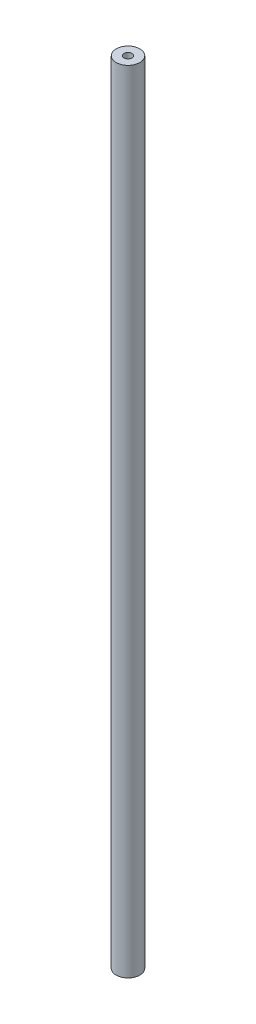
ISO-10303-21;
HEADER;
FILE_DESCRIPTION(('STEP AP214'),'2;1');
FILE_NAME('part.step','',(''),(''),'','','');
FILE_SCHEMA(('AUTOMOTIVE_DESIGN { 1 0 10303 214 1 1 1 1 }'));
ENDSEC;
DATA;
#1=APPLICATION_CONTEXT('core data for automotive mechanical design processes');
#2=APPLICATION_PROTOCOL_DEFINITION('international standard','automotive_design',2000,#1);
#3=PRODUCT_CONTEXT('',#1,'mechanical');
#4=PRODUCT('Part','Part','',(#3));
#5=PRODUCT_RELATED_PRODUCT_CATEGORY('part','',(#4));
#6=PRODUCT_DEFINITION_FORMATION('','',#4);
#7=PRODUCT_DEFINITION_CONTEXT('part definition',#1,'design');
#8=PRODUCT_DEFINITION('design','',#6,#7);
#9=PRODUCT_DEFINITION_SHAPE('','',#8);
#10=(LENGTH_UNIT() NAMED_UNIT(*) SI_UNIT(.MILLI.,.METRE.));
#11=(NAMED_UNIT(*) PLANE_ANGLE_UNIT() SI_UNIT($,.RADIAN.));
#12=(NAMED_UNIT(*) SI_UNIT($,.STERADIAN.) SOLID_ANGLE_UNIT());
#13=UNCERTAINTY_MEASURE_WITH_UNIT(LENGTH_MEASURE(1.E-05),#10,'distance_accuracy_value','');
#14=(GEOMETRIC_REPRESENTATION_CONTEXT(3) GLOBAL_UNCERTAINTY_ASSIGNED_CONTEXT((#13)) GLOBAL_UNIT_ASSIGNED_CONTEXT((#10,
#11,#12)) REPRESENTATION_CONTEXT('',''));
#15=CARTESIAN_POINT('',(0.,0.,0.));
#16=DIRECTION('',(0.,0.,1.));
#17=DIRECTION('',(1.,0.,0.));
#18=AXIS2_PLACEMENT_3D('',#15,#16,#17);
#19=CARTESIAN_POINT('',(0.,50.0001562498779,0.));
#20=DIRECTION('',(0.,-1.,0.));
#21=DIRECTION('',(0.,0.,-1.));
#22=AXIS2_PLACEMENT_3D('',#19,#20,#21);
#23=CYLINDRICAL_SURFACE('',#22,1.5);
#24=CARTESIAN_POINT('',(0.,-50.0001562498779,0.));
#25=DIRECTION('',(0.,1.,0.));
#26=DIRECTION('',(0.,0.,1.));
#27=AXIS2_PLACEMENT_3D('',#24,#25,#26);
#28=CIRCLE('',#27,1.5);
#29=CARTESIAN_POINT('',(0.,-50.0001562498779,1.5));
#30=VERTEX_POINT('',#29);
#31=EDGE_CURVE('E53',#30,#30,#28,.T.);
#32=ORIENTED_EDGE('',*,*,#31,.T.);
#33=EDGE_LOOP('',(#32));
#34=FACE_BOUND('',#33,.T.);
#35=CARTESIAN_POINT('',(0.,50.0001562498779,0.));
#36=DIRECTION('',(0.,1.,0.));
#37=DIRECTION('',(0.,0.,1.));
#38=AXIS2_PLACEMENT_3D('',#35,#36,#37);
#39=CIRCLE('',#38,1.5);
#40=CARTESIAN_POINT('',(0.,50.0001562498779,1.5));
#41=VERTEX_POINT('',#40);
#42=EDGE_CURVE('E44',#41,#41,#39,.T.);
#43=ORIENTED_EDGE('',*,*,#42,.F.);
#44=EDGE_LOOP('',(#43));
#45=FACE_BOUND('',#44,.T.);
#46=ADVANCED_FACE('F41',(#34,#45),#23,.T.);
#47=CARTESIAN_POINT('',(0.,50.0001562498779,0.));
#48=DIRECTION('',(0.,1.,0.));
#49=DIRECTION('',(0.,0.,1.));
#50=AXIS2_PLACEMENT_3D('',#47,#48,#49);
#51=PLANE('',#50);
#52=CARTESIAN_POINT('',(0.,50.0001562498779,0.));
#53=DIRECTION('',(0.,1.,0.));
#54=DIRECTION('',(0.,0.,1.));
#55=AXIS2_PLACEMENT_3D('',#52,#53,#54);
#56=CIRCLE('',#55,0.5);
#57=CARTESIAN_POINT('',(0.,50.0001562498779,0.5));
#58=VERTEX_POINT('',#57);
#59=EDGE_CURVE('E48',#58,#58,#56,.F.);
#60=ORIENTED_EDGE('',*,*,#59,.T.);
#61=EDGE_LOOP('',(#60));
#62=FACE_BOUND('',#61,.T.);
#63=ORIENTED_EDGE('',*,*,#42,.T.);
#64=EDGE_LOOP('',(#63));
#65=FACE_BOUND('',#64,.T.);
#66=ADVANCED_FACE('F61',(#62,#65),#51,.T.);
#67=CARTESIAN_POINT('',(0.,-50.0001562498779,0.));
#68=DIRECTION('',(0.,1.,0.));
#69=DIRECTION('',(0.,0.,1.));
#70=AXIS2_PLACEMENT_3D('',#67,#68,#69);
#71=PLANE('',#70);
#72=CARTESIAN_POINT('',(0.,-50.0001562498779,0.));
#73=DIRECTION('',(0.,1.,0.));
#74=DIRECTION('',(0.,0.,1.));
#75=AXIS2_PLACEMENT_3D('',#72,#73,#74);
#76=CIRCLE('',#75,0.5);
#77=CARTESIAN_POINT('',(0.,-50.0001562498779,0.5));
#78=VERTEX_POINT('',#77);
#79=EDGE_CURVE('E10',#78,#78,#76,.F.);
#80=ORIENTED_EDGE('',*,*,#79,.F.);
#81=EDGE_LOOP('',(#80));
#82=FACE_BOUND('',#81,.T.);
#83=ORIENTED_EDGE('',*,*,#31,.F.);
#84=EDGE_LOOP('',(#83));
#85=FACE_BOUND('',#84,.T.);
#86=ADVANCED_FACE('F67',(#82,#85),#71,.F.);
#87=CARTESIAN_POINT('',(0.,50.0001562498779,0.));
#88=DIRECTION('',(0.,-1.,0.));
#89=DIRECTION('',(0.,0.,-1.));
#90=AXIS2_PLACEMENT_3D('',#87,#88,#89);
#91=CYLINDRICAL_SURFACE('',#90,0.5);
#92=ORIENTED_EDGE('',*,*,#79,.T.);
#93=EDGE_LOOP('',(#92));
#94=FACE_BOUND('',#93,.T.);
#95=ORIENTED_EDGE('',*,*,#59,.F.);
#96=EDGE_LOOP('',(#95));
#97=FACE_BOUND('',#96,.T.);
#98=ADVANCED_FACE('F69',(#94,#97),#91,.F.);
#99=CLOSED_SHELL('',(#46,#66,#86,#98));
#100=MANIFOLD_SOLID_BREP('B2',#99);
#101=ADVANCED_BREP_SHAPE_REPRESENTATION('',(#18,#100),#14);
#102=SHAPE_DEFINITION_REPRESENTATION(#9,#101);
ENDSEC;
END-ISO-10303-21;
